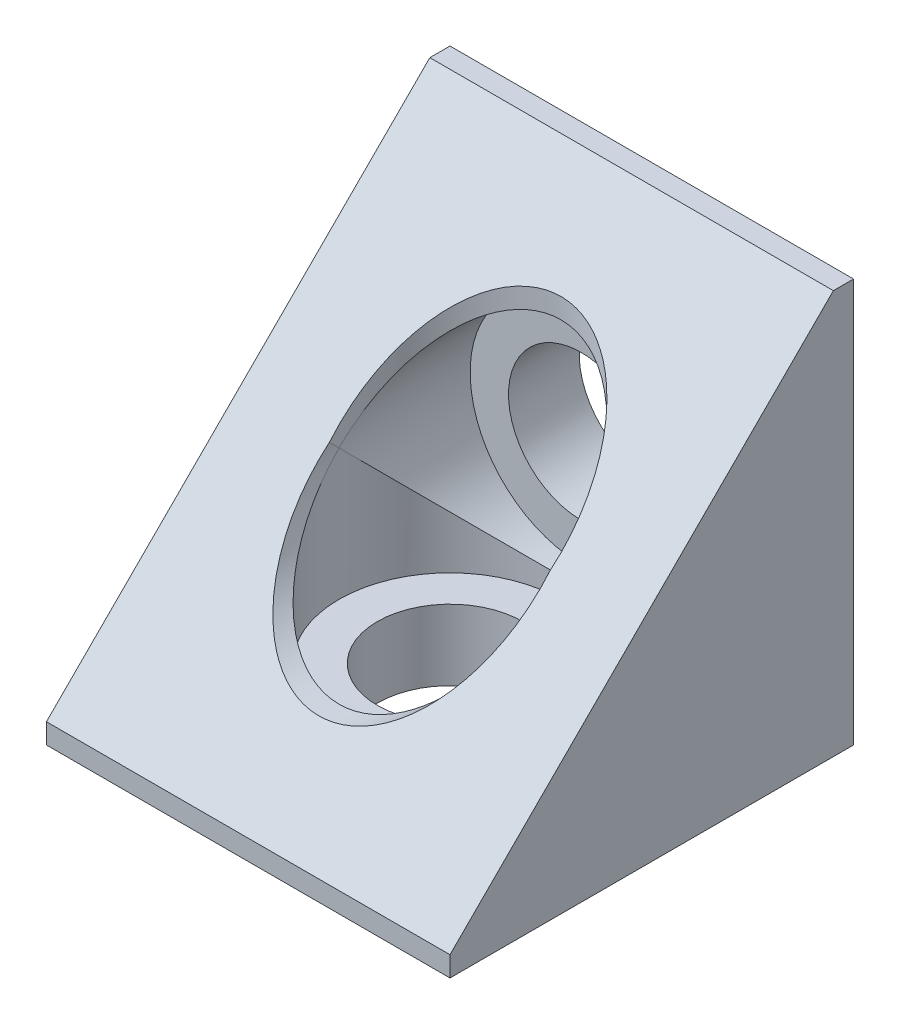
ISO-10303-21;
HEADER;
FILE_DESCRIPTION(('STEP AP214'),'2;1');
FILE_NAME('part.step','',(''),(''),'','','');
FILE_SCHEMA(('AUTOMOTIVE_DESIGN { 1 0 10303 214 1 1 1 1 }'));
ENDSEC;
DATA;
#1=APPLICATION_CONTEXT('core data for automotive mechanical design processes');
#2=APPLICATION_PROTOCOL_DEFINITION('international standard','automotive_design',2000,#1);
#3=PRODUCT_CONTEXT('',#1,'mechanical');
#4=PRODUCT('Part','Part','',(#3));
#5=PRODUCT_RELATED_PRODUCT_CATEGORY('part','',(#4));
#6=PRODUCT_DEFINITION_FORMATION('','',#4);
#7=PRODUCT_DEFINITION_CONTEXT('part definition',#1,'design');
#8=PRODUCT_DEFINITION('design','',#6,#7);
#9=PRODUCT_DEFINITION_SHAPE('','',#8);
#10=(LENGTH_UNIT() NAMED_UNIT(*) SI_UNIT(.MILLI.,.METRE.));
#11=(NAMED_UNIT(*) PLANE_ANGLE_UNIT() SI_UNIT($,.RADIAN.));
#12=(NAMED_UNIT(*) SI_UNIT($,.STERADIAN.) SOLID_ANGLE_UNIT());
#13=UNCERTAINTY_MEASURE_WITH_UNIT(LENGTH_MEASURE(1.E-05),#10,'distance_accuracy_value','');
#14=(GEOMETRIC_REPRESENTATION_CONTEXT(3) GLOBAL_UNCERTAINTY_ASSIGNED_CONTEXT((#13)) GLOBAL_UNIT_ASSIGNED_CONTEXT((#10,
#11,#12)) REPRESENTATION_CONTEXT('',''));
#15=CARTESIAN_POINT('',(0.,0.,0.));
#16=DIRECTION('',(0.,0.,1.));
#17=DIRECTION('',(1.,0.,0.));
#18=AXIS2_PLACEMENT_3D('',#15,#16,#17);
#19=CARTESIAN_POINT('',(0.,0.,-6.5));
#20=DIRECTION('',(0.,0.,1.));
#21=DIRECTION('',(1.,0.,0.));
#22=AXIS2_PLACEMENT_3D('',#19,#20,#21);
#23=CYLINDRICAL_SURFACE('',#22,5.5);
#24=CARTESIAN_POINT('',(0.,0.,0.));
#25=DIRECTION('',(0.,-0.707106781186547,0.707106781186547));
#26=DIRECTION('',(0.,0.707106781186547,0.707106781186547));
#27=AXIS2_PLACEMENT_3D('',#24,#25,#26);
#28=ELLIPSE('',#27,7.77817459305202,5.5);
#29=CARTESIAN_POINT('',(-5.5,0.,0.));
#30=VERTEX_POINT('',#29);
#31=CARTESIAN_POINT('',(-5.47722557505165,0.500000000000052,0.500000000000055));
#32=VERTEX_POINT('',#31);
#33=EDGE_CURVE('E149',#30,#32,#28,.F.);
#34=ORIENTED_EDGE('',*,*,#33,.T.);
#35=CARTESIAN_POINT('',(0.,0.,1.0000000000001));
#36=DIRECTION('',(0.,-0.707106781186544,-0.707106781186552));
#37=DIRECTION('',(0.,-0.707106781186552,0.707106781186544));
#38=AXIS2_PLACEMENT_3D('',#35,#36,#37);
#39=ELLIPSE('',#38,7.77817459305198,5.5);
#40=CARTESIAN_POINT('',(5.47722557505166,0.500000000000053,0.500000000000053));
#41=VERTEX_POINT('',#40);
#42=EDGE_CURVE('E58',#32,#41,#39,.F.);
#43=ORIENTED_EDGE('',*,*,#42,.T.);
#44=CARTESIAN_POINT('',(5.5,0.,0.));
#45=VERTEX_POINT('',#44);
#46=EDGE_CURVE('E139',#41,#45,#28,.F.);
#47=ORIENTED_EDGE('',*,*,#46,.T.);
#48=CARTESIAN_POINT('',(0.,0.,0.));
#49=DIRECTION('',(0.,0.707106781186547,0.707106781186547));
#50=DIRECTION('',(0.,-0.707106781186547,0.707106781186547));
#51=AXIS2_PLACEMENT_3D('',#48,#49,#50);
#52=ELLIPSE('',#51,7.77817459305202,5.5);
#53=EDGE_CURVE('E44',#45,#30,#52,.F.);
#54=ORIENTED_EDGE('',*,*,#53,.T.);
#55=EDGE_LOOP('',(#34,#43,#47,#54));
#56=FACE_BOUND('',#55,.T.);
#57=ADVANCED_FACE('F36',(#56),#23,.F.);
#58=CARTESIAN_POINT('',(0.,-10.,0.));
#59=DIRECTION('',(0.,1.,0.));
#60=DIRECTION('',(-1.,0.,0.));
#61=AXIS2_PLACEMENT_3D('',#58,#59,#60);
#62=CYLINDRICAL_SURFACE('',#61,3.6);
#63=CARTESIAN_POINT('',(0.,-10.,0.));
#64=DIRECTION('',(0.,1.,0.));
#65=DIRECTION('',(-1.,0.,0.));
#66=AXIS2_PLACEMENT_3D('',#63,#64,#65);
#67=CIRCLE('',#66,3.6);
#68=CARTESIAN_POINT('',(-3.6,-10.,0.));
#69=VERTEX_POINT('',#68);
#70=EDGE_CURVE('E147',#69,#69,#67,.T.);
#71=ORIENTED_EDGE('',*,*,#70,.F.);
#72=EDGE_LOOP('',(#71));
#73=FACE_BOUND('',#72,.T.);
#74=CARTESIAN_POINT('',(0.,-6.5,0.));
#75=DIRECTION('',(0.,1.,0.));
#76=DIRECTION('',(-1.,0.,0.));
#77=AXIS2_PLACEMENT_3D('',#74,#75,#76);
#78=CIRCLE('',#77,3.6);
#79=CARTESIAN_POINT('',(-3.6,-6.50000000000001,0.));
#80=VERTEX_POINT('',#79);
#81=EDGE_CURVE('E144',#80,#80,#78,.F.);
#82=ORIENTED_EDGE('',*,*,#81,.F.);
#83=EDGE_LOOP('',(#82));
#84=FACE_BOUND('',#83,.T.);
#85=ADVANCED_FACE('F194',(#73,#84),#62,.F.);
#86=CARTESIAN_POINT('',(0.,0.,10.));
#87=DIRECTION('',(0.,0.,-1.));
#88=DIRECTION('',(-1.,0.,0.));
#89=AXIS2_PLACEMENT_3D('',#86,#87,#88);
#90=CYLINDRICAL_SURFACE('',#89,3.6);
#91=CARTESIAN_POINT('',(0.,0.,-10.));
#92=DIRECTION('',(0.,0.,1.));
#93=DIRECTION('',(1.,0.,0.));
#94=AXIS2_PLACEMENT_3D('',#91,#92,#93);
#95=CIRCLE('',#94,3.6);
#96=CARTESIAN_POINT('',(3.6,0.,-10.));
#97=VERTEX_POINT('',#96);
#98=EDGE_CURVE('E121',#97,#97,#95,.T.);
#99=ORIENTED_EDGE('',*,*,#98,.F.);
#100=EDGE_LOOP('',(#99));
#101=FACE_BOUND('',#100,.T.);
#102=CARTESIAN_POINT('',(0.,0.,-6.5));
#103=DIRECTION('',(0.,0.,1.));
#104=DIRECTION('',(1.,0.,0.));
#105=AXIS2_PLACEMENT_3D('',#102,#103,#104);
#106=CIRCLE('',#105,3.6);
#107=CARTESIAN_POINT('',(3.6,0.,-6.5));
#108=VERTEX_POINT('',#107);
#109=EDGE_CURVE('E140',#108,#108,#106,.T.);
#110=ORIENTED_EDGE('',*,*,#109,.T.);
#111=EDGE_LOOP('',(#110));
#112=FACE_BOUND('',#111,.T.);
#113=ADVANCED_FACE('F198',(#101,#112),#90,.F.);
#114=CARTESIAN_POINT('',(0.,0.,10.));
#115=DIRECTION('',(0.,0.,1.));
#116=DIRECTION('',(1.,0.,0.));
#117=AXIS2_PLACEMENT_3D('',#114,#115,#116);
#118=PLANE('',#117);
#119=DIRECTION('',(1.,0.,0.));
#120=VECTOR('',#119,1.);
#121=CARTESIAN_POINT('',(-9.99999999999999,-9.,10.));
#122=LINE('',#121,#120);
#123=CARTESIAN_POINT('',(-9.99999999999999,-9.,10.));
#124=VERTEX_POINT('',#123);
#125=CARTESIAN_POINT('',(10.,-9.,10.));
#126=VERTEX_POINT('',#125);
#127=EDGE_CURVE('E95',#124,#126,#122,.T.);
#128=ORIENTED_EDGE('',*,*,#127,.F.);
#129=DIRECTION('',(0.,-1.,0.));
#130=VECTOR('',#129,1.);
#131=CARTESIAN_POINT('',(-10.,-10.,10.));
#132=LINE('',#131,#130);
#133=CARTESIAN_POINT('',(-10.,-10.,10.));
#134=VERTEX_POINT('',#133);
#135=EDGE_CURVE('E104',#124,#134,#132,.T.);
#136=ORIENTED_EDGE('',*,*,#135,.T.);
#137=DIRECTION('',(1.,0.,0.));
#138=VECTOR('',#137,1.);
#139=CARTESIAN_POINT('',(10.,-10.,10.));
#140=LINE('',#139,#138);
#141=CARTESIAN_POINT('',(10.,-10.,10.));
#142=VERTEX_POINT('',#141);
#143=EDGE_CURVE('E113',#134,#142,#140,.T.);
#144=ORIENTED_EDGE('',*,*,#143,.T.);
#145=DIRECTION('',(0.,1.,0.));
#146=VECTOR('',#145,1.);
#147=CARTESIAN_POINT('',(10.,-10.,10.));
#148=LINE('',#147,#146);
#149=EDGE_CURVE('E107',#142,#126,#148,.T.);
#150=ORIENTED_EDGE('',*,*,#149,.T.);
#151=EDGE_LOOP('',(#128,#136,#144,#150));
#152=FACE_BOUND('',#151,.T.);
#153=ADVANCED_FACE('F103',(#152),#118,.T.);
#154=CARTESIAN_POINT('',(0.,0.,-10.));
#155=DIRECTION('',(0.,0.,1.));
#156=DIRECTION('',(1.,0.,0.));
#157=AXIS2_PLACEMENT_3D('',#154,#155,#156);
#158=PLANE('',#157);
#159=DIRECTION('',(0.,-1.,0.));
#160=VECTOR('',#159,1.);
#161=CARTESIAN_POINT('',(-10.,-10.,-10.));
#162=LINE('',#161,#160);
#163=CARTESIAN_POINT('',(-10.,9.99999999999999,-10.));
#164=VERTEX_POINT('',#163);
#165=CARTESIAN_POINT('',(-10.,-10.,-10.));
#166=VERTEX_POINT('',#165);
#167=EDGE_CURVE('E126',#164,#166,#162,.T.);
#168=ORIENTED_EDGE('',*,*,#167,.F.);
#169=DIRECTION('',(-1.,0.,0.));
#170=VECTOR('',#169,1.);
#171=CARTESIAN_POINT('',(10.,10.,-10.));
#172=LINE('',#171,#170);
#173=CARTESIAN_POINT('',(10.,10.,-10.));
#174=VERTEX_POINT('',#173);
#175=EDGE_CURVE('E114',#174,#164,#172,.T.);
#176=ORIENTED_EDGE('',*,*,#175,.F.);
#177=DIRECTION('',(0.,1.,0.));
#178=VECTOR('',#177,1.);
#179=CARTESIAN_POINT('',(10.,-10.,-10.));
#180=LINE('',#179,#178);
#181=CARTESIAN_POINT('',(10.,-10.,-10.));
#182=VERTEX_POINT('',#181);
#183=EDGE_CURVE('E118',#182,#174,#180,.T.);
#184=ORIENTED_EDGE('',*,*,#183,.F.);
#185=DIRECTION('',(1.,0.,0.));
#186=VECTOR('',#185,1.);
#187=CARTESIAN_POINT('',(10.,-10.,-10.));
#188=LINE('',#187,#186);
#189=EDGE_CURVE('E128',#166,#182,#188,.T.);
#190=ORIENTED_EDGE('',*,*,#189,.F.);
#191=EDGE_LOOP('',(#168,#176,#184,#190));
#192=FACE_BOUND('',#191,.T.);
#193=ORIENTED_EDGE('',*,*,#98,.T.);
#194=EDGE_LOOP('',(#193));
#195=FACE_BOUND('',#194,.T.);
#196=ADVANCED_FACE('F280',(#192,#195),#158,.F.);
#197=CARTESIAN_POINT('',(-10.,-10.,10.));
#198=DIRECTION('',(1.,0.,0.));
#199=DIRECTION('',(0.,0.,-1.));
#200=AXIS2_PLACEMENT_3D('',#197,#198,#199);
#201=PLANE('',#200);
#202=ORIENTED_EDGE('',*,*,#135,.F.);
#203=DIRECTION('',(0.,0.707106781186552,-0.707106781186544));
#204=VECTOR('',#203,1.);
#205=CARTESIAN_POINT('',(-9.99999999999999,-9.,10.));
#206=LINE('',#205,#204);
#207=CARTESIAN_POINT('',(-9.99999999999999,10.,-8.99999999999979));
#208=VERTEX_POINT('',#207);
#209=EDGE_CURVE('E92',#124,#208,#206,.T.);
#210=ORIENTED_EDGE('',*,*,#209,.T.);
#211=DIRECTION('',(0.,0.,-1.));
#212=VECTOR('',#211,1.);
#213=CARTESIAN_POINT('',(-10.,9.99999999999999,10.));
#214=LINE('',#213,#212);
#215=EDGE_CURVE('E125',#208,#164,#214,.T.);
#216=ORIENTED_EDGE('',*,*,#215,.T.);
#217=ORIENTED_EDGE('',*,*,#167,.T.);
#218=DIRECTION('',(0.,0.,-1.));
#219=VECTOR('',#218,1.);
#220=CARTESIAN_POINT('',(-10.,-10.,10.));
#221=LINE('',#220,#219);
#222=EDGE_CURVE('E112',#134,#166,#221,.T.);
#223=ORIENTED_EDGE('',*,*,#222,.F.);
#224=EDGE_LOOP('',(#202,#210,#216,#217,#223));
#225=FACE_BOUND('',#224,.T.);
#226=ADVANCED_FACE('F38',(#225),#201,.F.);
#227=CARTESIAN_POINT('',(10.,-10.,10.));
#228=DIRECTION('',(0.,1.,0.));
#229=DIRECTION('',(-1.,0.,0.));
#230=AXIS2_PLACEMENT_3D('',#227,#228,#229);
#231=PLANE('',#230);
#232=ORIENTED_EDGE('',*,*,#70,.T.);
#233=EDGE_LOOP('',(#232));
#234=FACE_BOUND('',#233,.T.);
#235=ORIENTED_EDGE('',*,*,#189,.T.);
#236=DIRECTION('',(0.,0.,-1.));
#237=VECTOR('',#236,1.);
#238=CARTESIAN_POINT('',(10.,-10.,10.));
#239=LINE('',#238,#237);
#240=EDGE_CURVE('E135',#142,#182,#239,.T.);
#241=ORIENTED_EDGE('',*,*,#240,.F.);
#242=ORIENTED_EDGE('',*,*,#143,.F.);
#243=ORIENTED_EDGE('',*,*,#222,.T.);
#244=EDGE_LOOP('',(#235,#241,#242,#243));
#245=FACE_BOUND('',#244,.T.);
#246=ADVANCED_FACE('F245',(#234,#245),#231,.F.);
#247=CARTESIAN_POINT('',(10.,-10.,10.));
#248=DIRECTION('',(-1.,0.,0.));
#249=DIRECTION('',(0.,0.,1.));
#250=AXIS2_PLACEMENT_3D('',#247,#248,#249);
#251=PLANE('',#250);
#252=DIRECTION('',(0.,0.,-1.));
#253=VECTOR('',#252,1.);
#254=CARTESIAN_POINT('',(10.,10.,10.));
#255=LINE('',#254,#253);
#256=CARTESIAN_POINT('',(10.,10.,-8.99999999999979));
#257=VERTEX_POINT('',#256);
#258=EDGE_CURVE('E133',#257,#174,#255,.T.);
#259=ORIENTED_EDGE('',*,*,#258,.F.);
#260=DIRECTION('',(0.,0.707106781186552,-0.707106781186544));
#261=VECTOR('',#260,1.);
#262=CARTESIAN_POINT('',(10.,-9.,10.));
#263=LINE('',#262,#261);
#264=EDGE_CURVE('E51',#126,#257,#263,.T.);
#265=ORIENTED_EDGE('',*,*,#264,.F.);
#266=ORIENTED_EDGE('',*,*,#149,.F.);
#267=ORIENTED_EDGE('',*,*,#240,.T.);
#268=ORIENTED_EDGE('',*,*,#183,.T.);
#269=EDGE_LOOP('',(#259,#265,#266,#267,#268));
#270=FACE_BOUND('',#269,.T.);
#271=ADVANCED_FACE('F189',(#270),#251,.F.);
#272=CARTESIAN_POINT('',(10.,10.,10.));
#273=DIRECTION('',(0.,-1.,0.));
#274=DIRECTION('',(1.,0.,0.));
#275=AXIS2_PLACEMENT_3D('',#272,#273,#274);
#276=PLANE('',#275);
#277=ORIENTED_EDGE('',*,*,#215,.F.);
#278=DIRECTION('',(1.,0.,0.));
#279=VECTOR('',#278,1.);
#280=CARTESIAN_POINT('',(-9.99999999999999,10.,-8.99999999999979));
#281=LINE('',#280,#279);
#282=EDGE_CURVE('E96',#208,#257,#281,.T.);
#283=ORIENTED_EDGE('',*,*,#282,.T.);
#284=ORIENTED_EDGE('',*,*,#258,.T.);
#285=ORIENTED_EDGE('',*,*,#175,.T.);
#286=EDGE_LOOP('',(#277,#283,#284,#285));
#287=FACE_BOUND('',#286,.T.);
#288=ADVANCED_FACE('F180',(#287),#276,.F.);
#289=CARTESIAN_POINT('',(0.,0.,0.));
#290=DIRECTION('',(0.,-0.707106781186547,0.707106781186547));
#291=DIRECTION('',(0.,0.707106781186547,0.707106781186547));
#292=AXIS2_PLACEMENT_3D('',#289,#290,#291);
#293=ELLIPSE('',#292,7.77817459305202,5.5);
#294=EDGE_CURVE('E152',#30,#45,#293,.T.);
#295=ORIENTED_EDGE('',*,*,#294,.T.);
#296=CARTESIAN_POINT('',(0.,0.,0.));
#297=DIRECTION('',(0.,0.707106781186547,0.707106781186547));
#298=DIRECTION('',(0.,-0.707106781186547,0.707106781186547));
#299=AXIS2_PLACEMENT_3D('',#296,#297,#298);
#300=ELLIPSE('',#299,7.77817459305202,5.5);
#301=EDGE_CURVE('E155',#45,#30,#300,.T.);
#302=ORIENTED_EDGE('',*,*,#301,.T.);
#303=EDGE_LOOP('',(#295,#302));
#304=FACE_BOUND('',#303,.T.);
#305=CARTESIAN_POINT('',(0.,0.,-6.5));
#306=DIRECTION('',(0.,0.,1.));
#307=DIRECTION('',(1.,0.,0.));
#308=AXIS2_PLACEMENT_3D('',#305,#306,#307);
#309=CIRCLE('',#308,5.5);
#310=CARTESIAN_POINT('',(5.5,0.,-6.5));
#311=VERTEX_POINT('',#310);
#312=EDGE_CURVE('E143',#311,#311,#309,.T.);
#313=ORIENTED_EDGE('',*,*,#312,.F.);
#314=EDGE_LOOP('',(#313));
#315=FACE_BOUND('',#314,.T.);
#316=ADVANCED_FACE('F165',(#304,#315),#23,.F.);
#317=CARTESIAN_POINT('',(0.,0.,-6.5));
#318=DIRECTION('',(0.,0.,1.));
#319=DIRECTION('',(1.,0.,0.));
#320=AXIS2_PLACEMENT_3D('',#317,#318,#319);
#321=PLANE('',#320);
#322=ORIENTED_EDGE('',*,*,#109,.F.);
#323=EDGE_LOOP('',(#322));
#324=FACE_BOUND('',#323,.T.);
#325=ORIENTED_EDGE('',*,*,#312,.T.);
#326=EDGE_LOOP('',(#325));
#327=FACE_BOUND('',#326,.T.);
#328=ADVANCED_FACE('F178',(#324,#327),#321,.T.);
#329=CARTESIAN_POINT('',(0.,-6.5,0.));
#330=DIRECTION('',(0.,1.,0.));
#331=DIRECTION('',(-1.,0.,0.));
#332=AXIS2_PLACEMENT_3D('',#329,#330,#331);
#333=PLANE('',#332);
#334=CARTESIAN_POINT('',(0.,-6.5,0.));
#335=DIRECTION('',(0.,1.,0.));
#336=DIRECTION('',(-1.,0.,0.));
#337=AXIS2_PLACEMENT_3D('',#334,#335,#336);
#338=CIRCLE('',#337,5.5);
#339=CARTESIAN_POINT('',(-5.5,-6.50000000000001,0.));
#340=VERTEX_POINT('',#339);
#341=EDGE_CURVE('E148',#340,#340,#338,.T.);
#342=ORIENTED_EDGE('',*,*,#341,.T.);
#343=EDGE_LOOP('',(#342));
#344=FACE_BOUND('',#343,.T.);
#345=ORIENTED_EDGE('',*,*,#81,.T.);
#346=EDGE_LOOP('',(#345));
#347=FACE_BOUND('',#346,.T.);
#348=ADVANCED_FACE('F186',(#344,#347),#333,.T.);
#349=CARTESIAN_POINT('',(0.,-6.5,0.));
#350=DIRECTION('',(0.,1.,0.));
#351=DIRECTION('',(-1.,0.,0.));
#352=AXIS2_PLACEMENT_3D('',#349,#350,#351);
#353=CYLINDRICAL_SURFACE('',#352,5.5);
#354=ORIENTED_EDGE('',*,*,#341,.F.);
#355=EDGE_LOOP('',(#354));
#356=FACE_BOUND('',#355,.T.);
#357=ORIENTED_EDGE('',*,*,#294,.F.);
#358=ORIENTED_EDGE('',*,*,#53,.F.);
#359=EDGE_LOOP('',(#357,#358));
#360=FACE_BOUND('',#359,.T.);
#361=ADVANCED_FACE('F208',(#356,#360),#353,.F.);
#362=ORIENTED_EDGE('',*,*,#46,.F.);
#363=CARTESIAN_POINT('',(0.,1.00000000000011,0.));
#364=DIRECTION('',(0.,-0.707106781186544,-0.707106781186552));
#365=DIRECTION('',(0.,0.707106781186552,-0.707106781186544));
#366=AXIS2_PLACEMENT_3D('',#363,#364,#365);
#367=ELLIPSE('',#366,7.77817459305207,5.5);
#368=EDGE_CURVE('E11',#41,#32,#367,.F.);
#369=ORIENTED_EDGE('',*,*,#368,.T.);
#370=ORIENTED_EDGE('',*,*,#33,.F.);
#371=ORIENTED_EDGE('',*,*,#301,.F.);
#372=EDGE_LOOP('',(#362,#369,#370,#371));
#373=FACE_BOUND('',#372,.T.);
#374=ADVANCED_FACE('F168',(#373),#353,.F.);
#375=CARTESIAN_POINT('',(-9.99999999999999,-9.,10.));
#376=DIRECTION('',(0.,-0.707106781186544,-0.707106781186552));
#377=DIRECTION('',(0.,0.707106781186552,-0.707106781186544));
#378=AXIS2_PLACEMENT_3D('',#375,#376,#377);
#379=PLANE('',#378);
#380=ORIENTED_EDGE('',*,*,#264,.T.);
#381=ORIENTED_EDGE('',*,*,#282,.F.);
#382=ORIENTED_EDGE('',*,*,#209,.F.);
#383=ORIENTED_EDGE('',*,*,#127,.T.);
#384=EDGE_LOOP('',(#380,#381,#382,#383));
#385=FACE_BOUND('',#384,.T.);
#386=ORIENTED_EDGE('',*,*,#368,.F.);
#387=ORIENTED_EDGE('',*,*,#42,.F.);
#388=EDGE_LOOP('',(#386,#387));
#389=FACE_BOUND('',#388,.T.);
#390=ADVANCED_FACE('F94',(#385,#389),#379,.F.);
#391=CLOSED_SHELL('',(#57,#85,#113,#153,#196,#226,#246,#271,#288,#316,#328,#348,#361,#374,#390));
#392=MANIFOLD_SOLID_BREP('B2',#391);
#393=ADVANCED_BREP_SHAPE_REPRESENTATION('',(#18,#392),#14);
#394=SHAPE_DEFINITION_REPRESENTATION(#9,#393);
ENDSEC;
END-ISO-10303-21;
